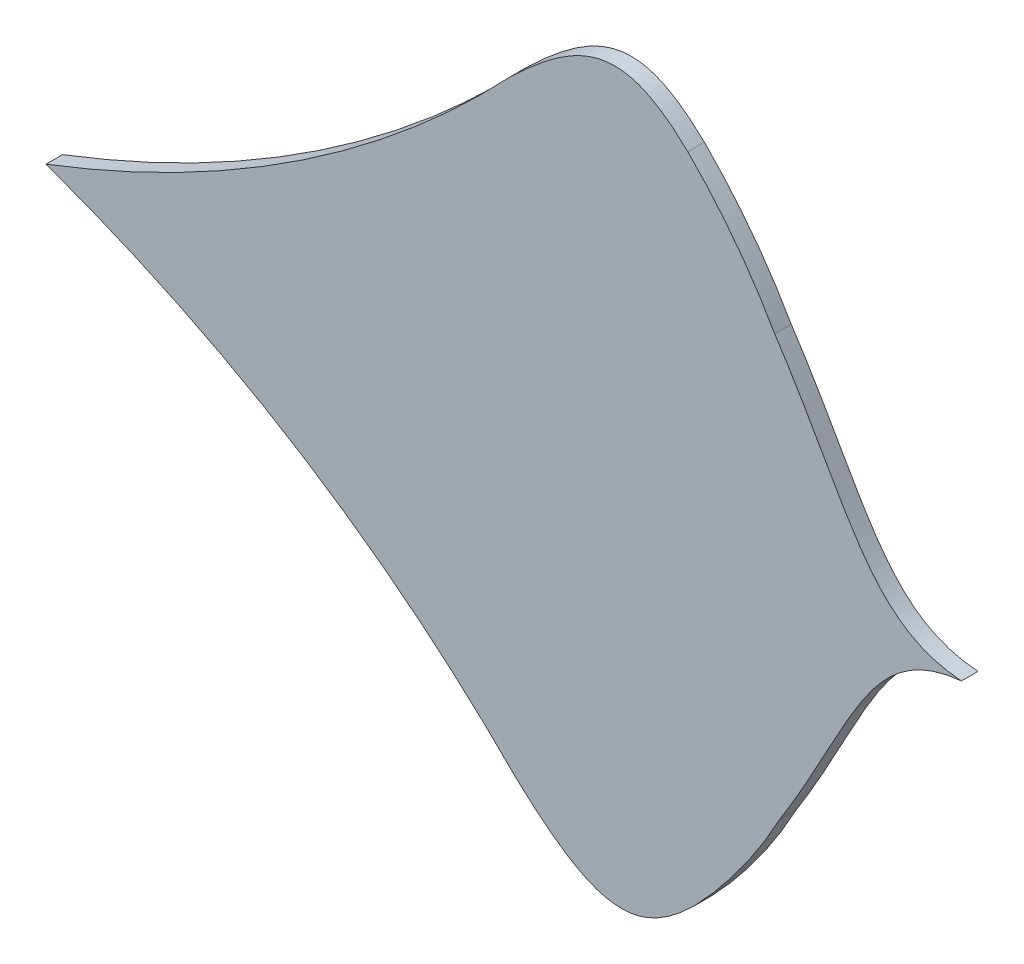
ISO-10303-21;
HEADER;
FILE_DESCRIPTION(('STEP AP214'),'2;1');
FILE_NAME('part.step','',(''),(''),'','','');
FILE_SCHEMA(('AUTOMOTIVE_DESIGN { 1 0 10303 214 1 1 1 1 }'));
ENDSEC;
DATA;
#1=APPLICATION_CONTEXT('core data for automotive mechanical design processes');
#2=APPLICATION_PROTOCOL_DEFINITION('international standard','automotive_design',2000,#1);
#3=PRODUCT_CONTEXT('',#1,'mechanical');
#4=PRODUCT('Part','Part','',(#3));
#5=PRODUCT_RELATED_PRODUCT_CATEGORY('part','',(#4));
#6=PRODUCT_DEFINITION_FORMATION('','',#4);
#7=PRODUCT_DEFINITION_CONTEXT('part definition',#1,'design');
#8=PRODUCT_DEFINITION('design','',#6,#7);
#9=PRODUCT_DEFINITION_SHAPE('','',#8);
#10=(LENGTH_UNIT() NAMED_UNIT(*) SI_UNIT(.MILLI.,.METRE.));
#11=(NAMED_UNIT(*) PLANE_ANGLE_UNIT() SI_UNIT($,.RADIAN.));
#12=(NAMED_UNIT(*) SI_UNIT($,.STERADIAN.) SOLID_ANGLE_UNIT());
#13=UNCERTAINTY_MEASURE_WITH_UNIT(LENGTH_MEASURE(1.E-05),#10,'distance_accuracy_value','');
#14=(GEOMETRIC_REPRESENTATION_CONTEXT(3) GLOBAL_UNCERTAINTY_ASSIGNED_CONTEXT((#13)) GLOBAL_UNIT_ASSIGNED_CONTEXT((#10,
#11,#12)) REPRESENTATION_CONTEXT('',''));
#15=CARTESIAN_POINT('',(0.,0.,0.));
#16=DIRECTION('',(0.,0.,1.));
#17=DIRECTION('',(1.,0.,0.));
#18=AXIS2_PLACEMENT_3D('',#15,#16,#17);
#19=CARTESIAN_POINT('',(409.224868448994,431.812362674436,10.));
#20=CARTESIAN_POINT('',(353.208318774805,435.814996737777,10.));
#21=CARTESIAN_POINT('',(341.801830866815,488.161683055043,10.));
#22=CARTESIAN_POINT('',(296.446812903311,556.976193068635,10.));
#23=B_SPLINE_CURVE_WITH_KNOTS('',3,(#19,#20,#21,#22),.UNSPECIFIED.,.F.,.F.,(4,4),(0.,1.),.UNSPECIFIED.);
#24=DIRECTION('',(0.,0.,-1.));
#25=VECTOR('',#24,1.);
#26=SURFACE_OF_LINEAR_EXTRUSION('',#23,#25);
#27=CARTESIAN_POINT('',(409.224868448994,431.812362674436,0.));
#28=CARTESIAN_POINT('',(353.208318774805,435.814996737777,0.));
#29=CARTESIAN_POINT('',(341.801830866815,488.161683055043,0.));
#30=CARTESIAN_POINT('',(296.446812903311,556.976193068635,0.));
#31=B_SPLINE_CURVE_WITH_KNOTS('',3,(#27,#28,#29,#30),.UNSPECIFIED.,.F.,.F.,(4,4),(0.,1.),.UNSPECIFIED.);
#32=CARTESIAN_POINT('',(409.224868448994,431.812362674436,0.));
#33=VERTEX_POINT('',#32);
#34=CARTESIAN_POINT('',(296.446812903311,556.976193068635,0.));
#35=VERTEX_POINT('',#34);
#36=EDGE_CURVE('E197',#33,#35,#31,.T.);
#37=ORIENTED_EDGE('',*,*,#36,.T.);
#38=DIRECTION('',(0.,0.,-1.));
#39=VECTOR('',#38,1.);
#40=CARTESIAN_POINT('',(296.446812903311,556.976193068635,10.));
#41=LINE('',#40,#39);
#42=CARTESIAN_POINT('',(296.446812903311,556.976193068635,10.));
#43=VERTEX_POINT('',#42);
#44=EDGE_CURVE('E11',#43,#35,#41,.T.);
#45=ORIENTED_EDGE('',*,*,#44,.F.);
#46=CARTESIAN_POINT('',(409.224868448994,431.812362674436,10.));
#47=VERTEX_POINT('',#46);
#48=EDGE_CURVE('E247',#47,#43,#23,.T.);
#49=ORIENTED_EDGE('',*,*,#48,.F.);
#50=DIRECTION('',(0.,0.,-1.));
#51=VECTOR('',#50,1.);
#52=CARTESIAN_POINT('',(409.224868448994,431.812362674436,10.));
#53=LINE('',#52,#51);
#54=EDGE_CURVE('E50',#47,#33,#53,.T.);
#55=ORIENTED_EDGE('',*,*,#54,.T.);
#56=EDGE_LOOP('',(#37,#45,#49,#55));
#57=FACE_BOUND('',#56,.T.);
#58=ADVANCED_FACE('F33',(#57),#26,.F.);
#59=CARTESIAN_POINT('',(296.446812903311,556.976193068635,10.));
#60=CARTESIAN_POINT('',(281.932763026281,582.589222263393,10.));
#61=CARTESIAN_POINT('',(264.405949262487,605.591633401765,10.));
#62=CARTESIAN_POINT('',(243.960653377675,626.036929286577,10.));
#63=B_SPLINE_CURVE_WITH_KNOTS('',3,(#59,#60,#61,#62),.UNSPECIFIED.,.F.,.F.,(4,4),(0.,1.),.UNSPECIFIED.);
#64=DIRECTION('',(0.,0.,-1.));
#65=VECTOR('',#64,1.);
#66=SURFACE_OF_LINEAR_EXTRUSION('',#63,#65);
#67=CARTESIAN_POINT('',(296.446812903311,556.976193068635,0.));
#68=CARTESIAN_POINT('',(281.932763026281,582.589222263393,0.));
#69=CARTESIAN_POINT('',(264.405949262487,605.591633401765,0.));
#70=CARTESIAN_POINT('',(243.960653377675,626.036929286577,0.));
#71=B_SPLINE_CURVE_WITH_KNOTS('',3,(#67,#68,#69,#70),.UNSPECIFIED.,.F.,.F.,(4,4),(0.,1.),.UNSPECIFIED.);
#72=CARTESIAN_POINT('',(243.960653377675,626.036929286577,0.));
#73=VERTEX_POINT('',#72);
#74=EDGE_CURVE('E190',#35,#73,#71,.T.);
#75=ORIENTED_EDGE('',*,*,#74,.T.);
#76=DIRECTION('',(0.,0.,-1.));
#77=VECTOR('',#76,1.);
#78=CARTESIAN_POINT('',(243.960653377675,626.036929286577,10.));
#79=LINE('',#78,#77);
#80=CARTESIAN_POINT('',(243.960653377675,626.036929286577,10.));
#81=VERTEX_POINT('',#80);
#82=EDGE_CURVE('E42',#81,#73,#79,.T.);
#83=ORIENTED_EDGE('',*,*,#82,.F.);
#84=EDGE_CURVE('E88',#43,#81,#63,.T.);
#85=ORIENTED_EDGE('',*,*,#84,.F.);
#86=ORIENTED_EDGE('',*,*,#44,.T.);
#87=EDGE_LOOP('',(#75,#83,#85,#86));
#88=FACE_BOUND('',#87,.T.);
#89=ADVANCED_FACE('F184',(#88),#66,.F.);
#90=CARTESIAN_POINT('',(243.960653377675,626.036929286577,10.));
#91=CARTESIAN_POINT('',(206.568548087952,661.953958926881,10.));
#92=CARTESIAN_POINT('',(181.063496858819,654.384446294044,10.));
#93=CARTESIAN_POINT('',(136.216103642129,611.031966184577,10.));
#94=B_SPLINE_CURVE_WITH_KNOTS('',3,(#90,#91,#92,#93),.UNSPECIFIED.,.F.,.F.,(4,4),(0.,1.),.UNSPECIFIED.);
#95=DIRECTION('',(0.,0.,-1.));
#96=VECTOR('',#95,1.);
#97=SURFACE_OF_LINEAR_EXTRUSION('',#94,#96);
#98=CARTESIAN_POINT('',(243.960653377675,626.036929286577,0.));
#99=CARTESIAN_POINT('',(206.568548087952,661.953958926881,0.));
#100=CARTESIAN_POINT('',(181.063496858819,654.384446294044,0.));
#101=CARTESIAN_POINT('',(136.216103642129,611.031966184577,0.));
#102=B_SPLINE_CURVE_WITH_KNOTS('',3,(#98,#99,#100,#101),.UNSPECIFIED.,.F.,.F.,(4,4),(0.,1.),.UNSPECIFIED.);
#103=CARTESIAN_POINT('',(136.216103642129,611.031966184577,0.));
#104=VERTEX_POINT('',#103);
#105=EDGE_CURVE('E196',#73,#104,#102,.T.);
#106=ORIENTED_EDGE('',*,*,#105,.T.);
#107=DIRECTION('',(0.,0.,-1.));
#108=VECTOR('',#107,1.);
#109=CARTESIAN_POINT('',(136.216103642129,611.031966184577,10.));
#110=LINE('',#109,#108);
#111=CARTESIAN_POINT('',(136.216103642129,611.031966184577,10.));
#112=VERTEX_POINT('',#111);
#113=EDGE_CURVE('E201',#112,#104,#110,.T.);
#114=ORIENTED_EDGE('',*,*,#113,.F.);
#115=EDGE_CURVE('E168',#81,#112,#94,.T.);
#116=ORIENTED_EDGE('',*,*,#115,.F.);
#117=ORIENTED_EDGE('',*,*,#82,.T.);
#118=EDGE_LOOP('',(#106,#114,#116,#117));
#119=FACE_BOUND('',#118,.T.);
#120=ADVANCED_FACE('F182',(#119),#97,.F.);
#121=CARTESIAN_POINT('',(136.216103642129,611.031966184577,10.));
#122=CARTESIAN_POINT('',(21.1489213258158,488.87160139671,10.));
#123=CARTESIAN_POINT('',(-143.606904724721,425.684916912658,10.));
#124=B_SPLINE_CURVE_WITH_KNOTS('',2,(#121,#122,#123),.UNSPECIFIED.,.F.,.F.,(3,3),(0.,1.),.UNSPECIFIED.);
#125=DIRECTION('',(0.,0.,-1.));
#126=VECTOR('',#125,1.);
#127=SURFACE_OF_LINEAR_EXTRUSION('',#124,#126);
#128=CARTESIAN_POINT('',(136.216103642129,611.031966184577,0.));
#129=CARTESIAN_POINT('',(21.1489213258158,488.87160139671,0.));
#130=CARTESIAN_POINT('',(-143.606904724721,425.684916912658,0.));
#131=B_SPLINE_CURVE_WITH_KNOTS('',2,(#128,#129,#130),.UNSPECIFIED.,.F.,.F.,(3,3),(0.,1.),.UNSPECIFIED.);
#132=CARTESIAN_POINT('',(-143.606904724721,425.684916912658,0.));
#133=VERTEX_POINT('',#132);
#134=EDGE_CURVE('E206',#104,#133,#131,.T.);
#135=ORIENTED_EDGE('',*,*,#134,.T.);
#136=DIRECTION('',(0.,0.,-1.));
#137=VECTOR('',#136,1.);
#138=CARTESIAN_POINT('',(-143.606904724721,425.684916912658,10.));
#139=LINE('',#138,#137);
#140=CARTESIAN_POINT('',(-143.606904724721,425.684916912658,10.));
#141=VERTEX_POINT('',#140);
#142=EDGE_CURVE('E254',#141,#133,#139,.T.);
#143=ORIENTED_EDGE('',*,*,#142,.F.);
#144=EDGE_CURVE('E160',#112,#141,#124,.T.);
#145=ORIENTED_EDGE('',*,*,#144,.F.);
#146=ORIENTED_EDGE('',*,*,#113,.T.);
#147=EDGE_LOOP('',(#135,#143,#145,#146));
#148=FACE_BOUND('',#147,.T.);
#149=ADVANCED_FACE('F153',(#148),#127,.F.);
#150=CARTESIAN_POINT('',(140.25553366799,246.585612740292,10.));
#151=CARTESIAN_POINT('',(22.5089639941992,366.16552953812,10.));
#152=CARTESIAN_POINT('',(-143.606904724721,425.684916912658,10.));
#153=B_SPLINE_CURVE_WITH_KNOTS('',2,(#150,#151,#152),.UNSPECIFIED.,.F.,.F.,(3,3),(0.,1.),.UNSPECIFIED.);
#154=DIRECTION('',(0.,0.,-1.));
#155=VECTOR('',#154,1.);
#156=SURFACE_OF_LINEAR_EXTRUSION('',#153,#155);
#157=CARTESIAN_POINT('',(140.25553366799,246.585612740292,0.));
#158=CARTESIAN_POINT('',(22.5089639941992,366.16552953812,0.));
#159=CARTESIAN_POINT('',(-143.606904724721,425.684916912658,0.));
#160=B_SPLINE_CURVE_WITH_KNOTS('',2,(#157,#158,#159),.UNSPECIFIED.,.F.,.F.,(3,3),(0.,1.),.UNSPECIFIED.);
#161=CARTESIAN_POINT('',(140.25553366799,246.585612740292,0.));
#162=VERTEX_POINT('',#161);
#163=EDGE_CURVE('E208',#162,#133,#160,.T.);
#164=ORIENTED_EDGE('',*,*,#163,.F.);
#165=DIRECTION('',(0.,0.,-1.));
#166=VECTOR('',#165,1.);
#167=CARTESIAN_POINT('',(140.25553366799,246.585612740292,10.));
#168=LINE('',#167,#166);
#169=CARTESIAN_POINT('',(140.25553366799,246.585612740292,10.));
#170=VERTEX_POINT('',#169);
#171=EDGE_CURVE('E113',#170,#162,#168,.T.);
#172=ORIENTED_EDGE('',*,*,#171,.F.);
#173=EDGE_CURVE('E122',#170,#141,#153,.T.);
#174=ORIENTED_EDGE('',*,*,#173,.T.);
#175=ORIENTED_EDGE('',*,*,#142,.T.);
#176=EDGE_LOOP('',(#164,#172,#174,#175));
#177=FACE_BOUND('',#176,.T.);
#178=ADVANCED_FACE('F150',(#177),#156,.T.);
#179=CARTESIAN_POINT('',(248.306195430895,233.97246848495,10.));
#180=CARTESIAN_POINT('',(211.719368719145,197.235475312609,10.));
#181=CARTESIAN_POINT('',(186.052806812766,204.237814893452,10.));
#182=CARTESIAN_POINT('',(140.25553366799,246.585612740292,10.));
#183=B_SPLINE_CURVE_WITH_KNOTS('',3,(#179,#180,#181,#182),.UNSPECIFIED.,.F.,.F.,(4,4),(0.,1.),.UNSPECIFIED.);
#184=DIRECTION('',(0.,0.,-1.));
#185=VECTOR('',#184,1.);
#186=SURFACE_OF_LINEAR_EXTRUSION('',#183,#185);
#187=CARTESIAN_POINT('',(248.306195430895,233.97246848495,0.));
#188=CARTESIAN_POINT('',(211.719368719145,197.235475312609,0.));
#189=CARTESIAN_POINT('',(186.052806812766,204.237814893452,0.));
#190=CARTESIAN_POINT('',(140.25553366799,246.585612740292,0.));
#191=B_SPLINE_CURVE_WITH_KNOTS('',3,(#187,#188,#189,#190),.UNSPECIFIED.,.F.,.F.,(4,4),(0.,1.),.UNSPECIFIED.);
#192=CARTESIAN_POINT('',(248.306195430895,233.97246848495,0.));
#193=VERTEX_POINT('',#192);
#194=EDGE_CURVE('E109',#193,#162,#191,.T.);
#195=ORIENTED_EDGE('',*,*,#194,.F.);
#196=DIRECTION('',(0.,0.,-1.));
#197=VECTOR('',#196,1.);
#198=CARTESIAN_POINT('',(248.306195430895,233.97246848495,10.));
#199=LINE('',#198,#197);
#200=CARTESIAN_POINT('',(248.306195430895,233.97246848495,10.));
#201=VERTEX_POINT('',#200);
#202=EDGE_CURVE('E104',#201,#193,#199,.T.);
#203=ORIENTED_EDGE('',*,*,#202,.F.);
#204=EDGE_CURVE('E107',#201,#170,#183,.T.);
#205=ORIENTED_EDGE('',*,*,#204,.T.);
#206=ORIENTED_EDGE('',*,*,#171,.T.);
#207=EDGE_LOOP('',(#195,#203,#205,#206));
#208=FACE_BOUND('',#207,.T.);
#209=ADVANCED_FACE('F106',(#208),#186,.T.);
#210=CARTESIAN_POINT('',(299.248745784291,304.179582029137,10.));
#211=CARTESIAN_POINT('',(285.305968320031,278.251144649561,10.));
#212=CARTESIAN_POINT('',(268.293303375326,254.865906776735,10.));
#213=CARTESIAN_POINT('',(248.306195430895,233.97246848495,10.));
#214=B_SPLINE_CURVE_WITH_KNOTS('',3,(#210,#211,#212,#213),.UNSPECIFIED.,.F.,.F.,(4,4),(0.,1.),.UNSPECIFIED.);
#215=DIRECTION('',(0.,0.,-1.));
#216=VECTOR('',#215,1.);
#217=SURFACE_OF_LINEAR_EXTRUSION('',#214,#216);
#218=CARTESIAN_POINT('',(299.248745784291,304.179582029137,0.));
#219=CARTESIAN_POINT('',(285.305968320031,278.251144649561,0.));
#220=CARTESIAN_POINT('',(268.293303375326,254.865906776735,0.));
#221=CARTESIAN_POINT('',(248.306195430895,233.97246848495,0.));
#222=B_SPLINE_CURVE_WITH_KNOTS('',3,(#218,#219,#220,#221),.UNSPECIFIED.,.F.,.F.,(4,4),(0.,1.),.UNSPECIFIED.);
#223=CARTESIAN_POINT('',(299.248745784291,304.179582029137,0.));
#224=VERTEX_POINT('',#223);
#225=EDGE_CURVE('E232',#224,#193,#222,.T.);
#226=ORIENTED_EDGE('',*,*,#225,.F.);
#227=DIRECTION('',(0.,0.,-1.));
#228=VECTOR('',#227,1.);
#229=CARTESIAN_POINT('',(299.248745784291,304.179582029137,10.));
#230=LINE('',#229,#228);
#231=CARTESIAN_POINT('',(299.248745784291,304.179582029137,10.));
#232=VERTEX_POINT('',#231);
#233=EDGE_CURVE('E76',#232,#224,#230,.T.);
#234=ORIENTED_EDGE('',*,*,#233,.F.);
#235=EDGE_CURVE('E120',#232,#201,#214,.T.);
#236=ORIENTED_EDGE('',*,*,#235,.T.);
#237=ORIENTED_EDGE('',*,*,#202,.T.);
#238=EDGE_LOOP('',(#226,#234,#236,#237));
#239=FACE_BOUND('',#238,.T.);
#240=ADVANCED_FACE('F124',(#239),#217,.T.);
#241=CARTESIAN_POINT('',(409.224868448994,431.812362674436,10.));
#242=CARTESIAN_POINT('',(353.310797723157,426.569118286464,10.));
#243=CARTESIAN_POINT('',(343.067364018836,373.98246978384,10.));
#244=CARTESIAN_POINT('',(299.248745784291,304.179582029137,10.));
#245=B_SPLINE_CURVE_WITH_KNOTS('',3,(#241,#242,#243,#244),.UNSPECIFIED.,.F.,.F.,(4,4),(0.,1.),.UNSPECIFIED.);
#246=DIRECTION('',(0.,0.,-1.));
#247=VECTOR('',#246,1.);
#248=SURFACE_OF_LINEAR_EXTRUSION('',#245,#247);
#249=CARTESIAN_POINT('',(409.224868448994,431.812362674436,0.));
#250=CARTESIAN_POINT('',(353.310797723157,426.569118286464,0.));
#251=CARTESIAN_POINT('',(343.067364018836,373.98246978384,0.));
#252=CARTESIAN_POINT('',(299.248745784291,304.179582029137,0.));
#253=B_SPLINE_CURVE_WITH_KNOTS('',3,(#249,#250,#251,#252),.UNSPECIFIED.,.F.,.F.,(4,4),(0.,1.),.UNSPECIFIED.);
#254=EDGE_CURVE('E239',#33,#224,#253,.T.);
#255=ORIENTED_EDGE('',*,*,#254,.F.);
#256=ORIENTED_EDGE('',*,*,#54,.F.);
#257=EDGE_CURVE('E125',#47,#232,#245,.T.);
#258=ORIENTED_EDGE('',*,*,#257,.T.);
#259=ORIENTED_EDGE('',*,*,#233,.T.);
#260=EDGE_LOOP('',(#255,#256,#258,#259));
#261=FACE_BOUND('',#260,.T.);
#262=ADVANCED_FACE('F146',(#261),#248,.T.);
#263=CARTESIAN_POINT('',(348.837766284646,470.089824390191,10.));
#264=DIRECTION('',(0.,0.,1.));
#265=DIRECTION('',(1.,0.,0.));
#266=AXIS2_PLACEMENT_3D('',#263,#264,#265);
#267=PLANE('',#266);
#268=ORIENTED_EDGE('',*,*,#48,.T.);
#269=ORIENTED_EDGE('',*,*,#84,.T.);
#270=ORIENTED_EDGE('',*,*,#115,.T.);
#271=ORIENTED_EDGE('',*,*,#144,.T.);
#272=ORIENTED_EDGE('',*,*,#173,.F.);
#273=ORIENTED_EDGE('',*,*,#204,.F.);
#274=ORIENTED_EDGE('',*,*,#235,.F.);
#275=ORIENTED_EDGE('',*,*,#257,.F.);
#276=EDGE_LOOP('',(#268,#269,#270,#271,#272,#273,#274,#275));
#277=FACE_BOUND('',#276,.T.);
#278=ADVANCED_FACE('F118',(#277),#267,.T.);
#279=CARTESIAN_POINT('',(348.837766284646,470.089824390191,0.));
#280=DIRECTION('',(0.,0.,1.));
#281=DIRECTION('',(1.,0.,0.));
#282=AXIS2_PLACEMENT_3D('',#279,#280,#281);
#283=PLANE('',#282);
#284=ORIENTED_EDGE('',*,*,#36,.F.);
#285=ORIENTED_EDGE('',*,*,#254,.T.);
#286=ORIENTED_EDGE('',*,*,#225,.T.);
#287=ORIENTED_EDGE('',*,*,#194,.T.);
#288=ORIENTED_EDGE('',*,*,#163,.T.);
#289=ORIENTED_EDGE('',*,*,#134,.F.);
#290=ORIENTED_EDGE('',*,*,#105,.F.);
#291=ORIENTED_EDGE('',*,*,#74,.F.);
#292=EDGE_LOOP('',(#284,#285,#286,#287,#288,#289,#290,#291));
#293=FACE_BOUND('',#292,.T.);
#294=ADVANCED_FACE('F203',(#293),#283,.F.);
#295=CLOSED_SHELL('',(#58,#89,#120,#149,#178,#209,#240,#262,#278,#294));
#296=MANIFOLD_SOLID_BREP('B2',#295);
#297=ADVANCED_BREP_SHAPE_REPRESENTATION('',(#18,#296),#14);
#298=SHAPE_DEFINITION_REPRESENTATION(#9,#297);
ENDSEC;
END-ISO-10303-21;
